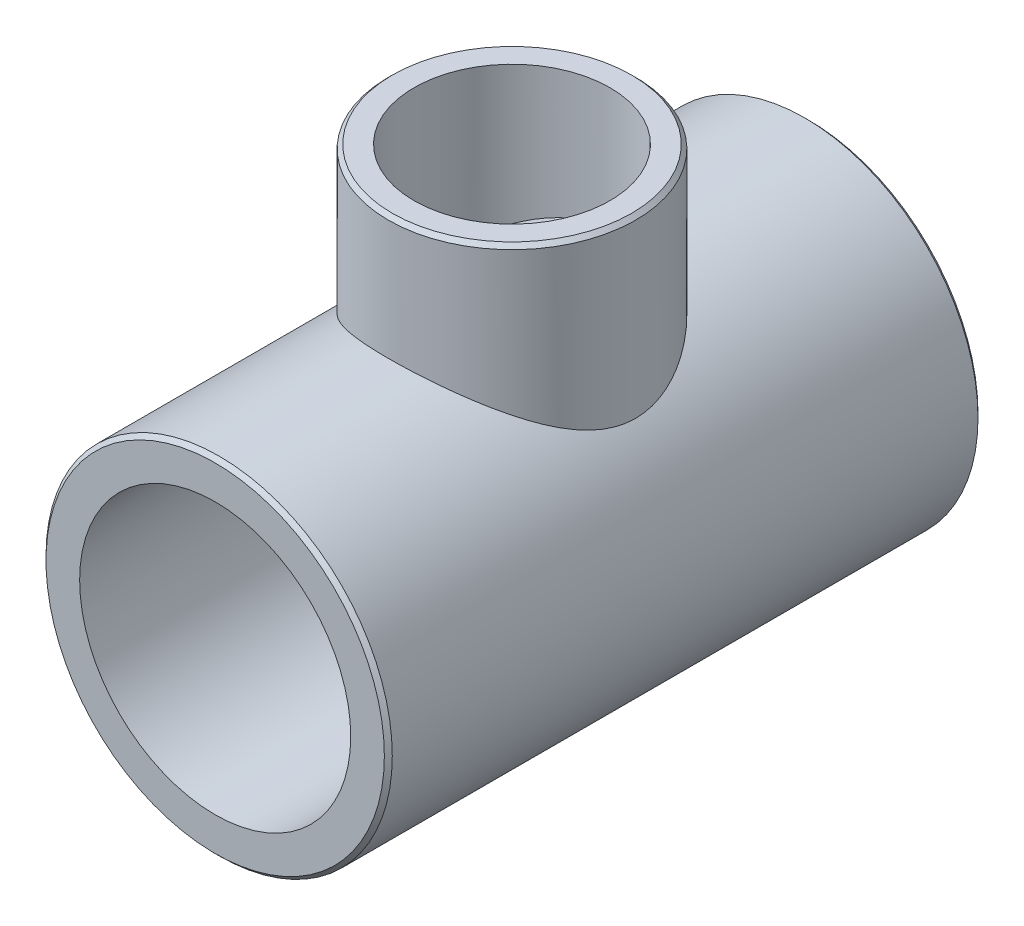
ISO-10303-21;
HEADER;
FILE_DESCRIPTION(('STEP AP214'),'2;1');
FILE_NAME('part.step','',(''),(''),'','','');
FILE_SCHEMA(('AUTOMOTIVE_DESIGN { 1 0 10303 214 1 1 1 1 }'));
ENDSEC;
DATA;
#1=APPLICATION_CONTEXT('core data for automotive mechanical design processes');
#2=APPLICATION_PROTOCOL_DEFINITION('international standard','automotive_design',2000,#1);
#3=PRODUCT_CONTEXT('',#1,'mechanical');
#4=PRODUCT('Part','Part','',(#3));
#5=PRODUCT_RELATED_PRODUCT_CATEGORY('part','',(#4));
#6=PRODUCT_DEFINITION_FORMATION('','',#4);
#7=PRODUCT_DEFINITION_CONTEXT('part definition',#1,'design');
#8=PRODUCT_DEFINITION('design','',#6,#7);
#9=PRODUCT_DEFINITION_SHAPE('','',#8);
#10=(LENGTH_UNIT() NAMED_UNIT(*) SI_UNIT(.MILLI.,.METRE.));
#11=(NAMED_UNIT(*) PLANE_ANGLE_UNIT() SI_UNIT($,.RADIAN.));
#12=(NAMED_UNIT(*) SI_UNIT($,.STERADIAN.) SOLID_ANGLE_UNIT());
#13=UNCERTAINTY_MEASURE_WITH_UNIT(LENGTH_MEASURE(1.E-05),#10,'distance_accuracy_value','');
#14=(GEOMETRIC_REPRESENTATION_CONTEXT(3) GLOBAL_UNCERTAINTY_ASSIGNED_CONTEXT((#13)) GLOBAL_UNIT_ASSIGNED_CONTEXT((#10,
#11,#12)) REPRESENTATION_CONTEXT('',''));
#15=CARTESIAN_POINT('',(0.,0.,0.));
#16=DIRECTION('',(0.,0.,1.));
#17=DIRECTION('',(1.,0.,0.));
#18=AXIS2_PLACEMENT_3D('',#15,#16,#17);
#19=CARTESIAN_POINT('',(0.,0.,19.05));
#20=DIRECTION('',(0.,0.,-1.));
#21=DIRECTION('',(-1.,0.,0.));
#22=AXIS2_PLACEMENT_3D('',#19,#20,#21);
#23=CYLINDRICAL_SURFACE('',#22,8.6995);
#24=CARTESIAN_POINT('',(0.,0.,19.05));
#25=DIRECTION('',(0.,0.,1.));
#26=DIRECTION('',(1.,0.,0.));
#27=AXIS2_PLACEMENT_3D('',#24,#25,#26);
#28=CIRCLE('',#27,8.6995);
#29=CARTESIAN_POINT('',(-8.6995,0.,19.05));
#30=VERTEX_POINT('',#29);
#31=EDGE_CURVE('E79',#30,#30,#28,.T.);
#32=CARTESIAN_POINT('',(0.,0.,-19.05));
#33=DIRECTION('',(0.,0.,1.));
#34=DIRECTION('',(1.,0.,0.));
#35=AXIS2_PLACEMENT_3D('',#32,#33,#34);
#36=CIRCLE('',#35,8.6995);
#37=CARTESIAN_POINT('',(-8.6995,0.,-19.05));
#38=VERTEX_POINT('',#37);
#39=EDGE_CURVE('E108',#38,#38,#36,.T.);
#40=CARTESIAN_POINT('',(-8.6995,0.,19.05));
#41=CARTESIAN_POINT('',(-8.6995,0.,18.653125));
#42=CARTESIAN_POINT('',(-8.6995,0.,18.25625));
#43=CARTESIAN_POINT('',(-8.6995,0.,17.4625));
#44=CARTESIAN_POINT('',(-8.6995,0.,17.065625));
#45=CARTESIAN_POINT('',(-8.6995,0.,16.271875));
#46=CARTESIAN_POINT('',(-8.6995,0.,15.875));
#47=CARTESIAN_POINT('',(-8.6995,0.,15.08125));
#48=CARTESIAN_POINT('',(-8.6995,0.,14.684375));
#49=CARTESIAN_POINT('',(-8.6995,0.,13.890625));
#50=CARTESIAN_POINT('',(-8.6995,0.,13.49375));
#51=CARTESIAN_POINT('',(-8.6995,0.,12.7));
#52=CARTESIAN_POINT('',(-8.6995,0.,12.303125));
#53=CARTESIAN_POINT('',(-8.6995,0.,11.509375));
#54=CARTESIAN_POINT('',(-8.6995,0.,11.1125));
#55=CARTESIAN_POINT('',(-8.6995,0.,10.31875));
#56=CARTESIAN_POINT('',(-8.6995,0.,9.921875));
#57=CARTESIAN_POINT('',(-8.6995,0.,9.128125));
#58=CARTESIAN_POINT('',(-8.6995,0.,8.73125));
#59=CARTESIAN_POINT('',(-8.6995,0.,7.9375));
#60=CARTESIAN_POINT('',(-8.6995,0.,7.540625));
#61=CARTESIAN_POINT('',(-8.6995,0.,6.746875));
#62=CARTESIAN_POINT('',(-8.6995,0.,6.35));
#63=CARTESIAN_POINT('',(-8.6995,0.,5.55625));
#64=CARTESIAN_POINT('',(-8.6995,0.,5.159375));
#65=CARTESIAN_POINT('',(-8.6995,0.,4.365625));
#66=CARTESIAN_POINT('',(-8.6995,0.,3.96875));
#67=CARTESIAN_POINT('',(-8.6995,0.,3.175));
#68=CARTESIAN_POINT('',(-8.6995,0.,2.778125));
#69=CARTESIAN_POINT('',(-8.6995,0.,1.984375));
#70=CARTESIAN_POINT('',(-8.6995,0.,1.5875));
#71=CARTESIAN_POINT('',(-8.6995,0.,0.793749999999997));
#72=CARTESIAN_POINT('',(-8.6995,0.,0.396874999999997));
#73=CARTESIAN_POINT('',(-8.6995,0.,-0.396875000000004));
#74=CARTESIAN_POINT('',(-8.6995,0.,-0.793750000000004));
#75=CARTESIAN_POINT('',(-8.6995,0.,-1.5875));
#76=CARTESIAN_POINT('',(-8.6995,0.,-1.984375));
#77=CARTESIAN_POINT('',(-8.6995,0.,-2.77812500000001));
#78=CARTESIAN_POINT('',(-8.6995,0.,-3.17500000000001));
#79=CARTESIAN_POINT('',(-8.6995,0.,-3.96875000000001));
#80=CARTESIAN_POINT('',(-8.6995,0.,-4.36562500000001));
#81=CARTESIAN_POINT('',(-8.6995,0.,-5.15937500000001));
#82=CARTESIAN_POINT('',(-8.6995,0.,-5.55625));
#83=CARTESIAN_POINT('',(-8.6995,0.,-6.35));
#84=CARTESIAN_POINT('',(-8.6995,0.,-6.746875));
#85=CARTESIAN_POINT('',(-8.6995,0.,-7.540625));
#86=CARTESIAN_POINT('',(-8.6995,0.,-7.93750000000001));
#87=CARTESIAN_POINT('',(-8.6995,0.,-8.73125));
#88=CARTESIAN_POINT('',(-8.6995,0.,-9.12812500000001));
#89=CARTESIAN_POINT('',(-8.6995,0.,-9.92187500000001));
#90=CARTESIAN_POINT('',(-8.6995,0.,-10.31875));
#91=CARTESIAN_POINT('',(-8.6995,0.,-11.1125));
#92=CARTESIAN_POINT('',(-8.6995,0.,-11.509375));
#93=CARTESIAN_POINT('',(-8.6995,0.,-12.303125));
#94=CARTESIAN_POINT('',(-8.6995,0.,-12.7));
#95=CARTESIAN_POINT('',(-8.6995,0.,-13.49375));
#96=CARTESIAN_POINT('',(-8.6995,0.,-13.890625));
#97=CARTESIAN_POINT('',(-8.6995,0.,-14.684375));
#98=CARTESIAN_POINT('',(-8.6995,0.,-15.08125));
#99=CARTESIAN_POINT('',(-8.6995,0.,-15.875));
#100=CARTESIAN_POINT('',(-8.6995,0.,-16.271875));
#101=CARTESIAN_POINT('',(-8.6995,0.,-17.065625));
#102=CARTESIAN_POINT('',(-8.6995,0.,-17.4625));
#103=CARTESIAN_POINT('',(-8.6995,0.,-18.25625));
#104=CARTESIAN_POINT('',(-8.6995,0.,-18.653125));
#105=CARTESIAN_POINT('',(-8.6995,0.,-19.05));
#106=B_SPLINE_CURVE_WITH_KNOTS('',3,(#40,#41,#42,#43,#44,#45,#46,#47,#48,#49,#50,#51,#52,#53,
#54,#55,#56,#57,#58,#59,#60,#61,#62,#63,#64,#65,#66,#67,#68,#69,#70,#71,#72,#73,#74,#75,#76,#77,
#78,#79,#80,#81,#82,#83,#84,#85,#86,#87,#88,#89,#90,#91,#92,#93,#94,#95,#96,#97,#98,#99,#100,
#101,#102,#103,#104,#105),.UNSPECIFIED.,.F.,.F.,(4,2,2,2,2,2,2,2,2,2,2,2,2,2,2,2,2,2,2,2,2,2,2,
2,2,2,2,2,2,2,2,2,4),(0.,1.190625,2.38125,3.571875,4.7625,5.953125,7.14375,8.334375,9.525,
10.715625,11.90625,13.096875,14.2875,15.478125,16.66875,17.859375,19.05,20.240625,21.43125,
22.621875,23.8125,25.003125,26.19375,27.384375,28.575,29.765625,30.95625,32.146875,33.3375,
34.528125,35.71875,36.909375,38.1),.UNSPECIFIED.);
#107=EDGE_CURVE('BSEAM38',#30,#38,#106,.T.);
#108=ORIENTED_EDGE('',*,*,#31,.T.);
#109=ORIENTED_EDGE('',*,*,#39,.F.);
#110=ORIENTED_EDGE('',*,*,#107,.T.);
#111=ORIENTED_EDGE('',*,*,#107,.F.);
#112=EDGE_LOOP('',(#108,#110,#109,#111));
#113=FACE_BOUND('',#112,.T.);
#114=ADVANCED_FACE('F38',(#113),#23,.F.);
#115=CARTESIAN_POINT('',(0.,0.,19.05));
#116=DIRECTION('',(0.,0.,-1.));
#117=DIRECTION('',(-1.,0.,0.));
#118=AXIS2_PLACEMENT_3D('',#115,#116,#117);
#119=CYLINDRICAL_SURFACE('',#118,11.1125);
#120=CARTESIAN_POINT('',(0.,0.,18.796));
#121=DIRECTION('',(0.,0.,1.));
#122=DIRECTION('',(1.,0.,0.));
#123=AXIS2_PLACEMENT_3D('',#120,#121,#122);
#124=CIRCLE('',#123,11.1125);
#125=CARTESIAN_POINT('',(11.1125,0.,18.796));
#126=VERTEX_POINT('',#125);
#127=EDGE_CURVE('E56',#126,#126,#124,.F.);
#128=ORIENTED_EDGE('',*,*,#127,.T.);
#129=EDGE_LOOP('',(#128));
#130=FACE_BOUND('',#129,.T.);
#131=CARTESIAN_POINT('',(0.,0.,-18.796));
#132=DIRECTION('',(0.,0.,1.));
#133=DIRECTION('',(1.,0.,0.));
#134=AXIS2_PLACEMENT_3D('',#131,#132,#133);
#135=CIRCLE('',#134,11.1125);
#136=CARTESIAN_POINT('',(11.1125,0.,-18.796));
#137=VERTEX_POINT('',#136);
#138=EDGE_CURVE('E62',#137,#137,#135,.T.);
#139=ORIENTED_EDGE('',*,*,#138,.T.);
#140=EDGE_LOOP('',(#139));
#141=FACE_BOUND('',#140,.T.);
#142=CARTESIAN_POINT('',(0.,11.1125,7.9375));
#143=CARTESIAN_POINT('',(0.196425340663455,11.1125003330193,7.93750035798998));
#144=CARTESIAN_POINT('',(0.392846435672446,11.1072813165904,7.93019874153173));
#145=CARTESIAN_POINT('',(0.784056037149215,11.0865359659218,7.90111597233613));
#146=CARTESIAN_POINT('',(0.978844591248941,11.0710099334731,7.87933524354933));
#147=CARTESIAN_POINT('',(1.36531639036845,11.0300202310666,7.82163715680664));
#148=CARTESIAN_POINT('',(1.55699850235083,11.0045530165245,7.7857147565194));
#149=CARTESIAN_POINT('',(1.93579912690144,10.9442735972476,7.70027858331352));
#150=CARTESIAN_POINT('',(2.12291754227784,10.90946119368,7.65076452121155));
#151=CARTESIAN_POINT('',(2.49041510089365,10.8314630703653,7.5391264563277));
#152=CARTESIAN_POINT('',(2.6708247327213,10.7883227559874,7.47707075057009));
#153=CARTESIAN_POINT('',(3.02505350621025,10.6944050991264,7.34091143651399));
#154=CARTESIAN_POINT('',(3.19887002464849,10.6436247559729,7.26680309353468));
#155=CARTESIAN_POINT('',(3.53901757595824,10.5354095866145,7.10735760156578));
#156=CARTESIAN_POINT('',(3.70535143210925,10.4779772999904,7.0220247362));
#157=CARTESIAN_POINT('',(4.03009009351049,10.3574149308245,6.84082379548175));
#158=CARTESIAN_POINT('',(4.18849192190175,10.294282733677,6.74495180733402));
#159=CARTESIAN_POINT('',(4.51066870628601,10.1575008816236,6.53437425485555));
#160=CARTESIAN_POINT('',(4.67365873168185,10.0834155172481,6.4187512651582));
#161=CARTESIAN_POINT('',(4.98926799654973,9.93104105909862,6.17662376090673));
#162=CARTESIAN_POINT('',(5.14188598839464,9.85275146162794,6.05011794141536));
#163=CARTESIAN_POINT('',(5.43666589290705,9.69321654246186,5.78668336614895));
#164=CARTESIAN_POINT('',(5.57881151727066,9.61196689838171,5.6497390207667));
#165=CARTESIAN_POINT('',(5.85209234813077,9.44807144945027,5.36616138825542));
#166=CARTESIAN_POINT('',(5.98323078829749,9.3654260632685,5.21953096946416));
#167=CARTESIAN_POINT('',(6.25743585908136,9.18497733294558,4.88903073346635));
#168=CARTESIAN_POINT('',(6.39824919525167,9.0871864359434,4.70327699167241));
#169=CARTESIAN_POINT('',(6.66364866798513,8.89439995750189,4.31905359507126));
#170=CARTESIAN_POINT('',(6.78823038024902,8.79940514363786,4.12058049521427));
#171=CARTESIAN_POINT('',(7.02023303248988,8.61544378532435,3.71153053877185));
#172=CARTESIAN_POINT('',(7.12767473743694,8.52647002287458,3.50096875482254));
#173=CARTESIAN_POINT('',(7.32447752038842,8.35801753584391,3.06796724535161));
#174=CARTESIAN_POINT('',(7.41384841012369,8.27853366828242,2.84553404890951));
#175=CARTESIAN_POINT('',(7.5475448921623,8.15644497583302,2.46279372718139));
#176=CARTESIAN_POINT('',(7.59712037593185,8.11019297402712,2.30546899452192));
#177=CARTESIAN_POINT('',(7.6867790059683,8.02526625982405,1.98615595336382));
#178=CARTESIAN_POINT('',(7.72686505880631,7.98658922787515,1.8241690899497));
#179=CARTESIAN_POINT('',(7.79695599929007,7.91817750216264,1.49646411183777));
#180=CARTESIAN_POINT('',(7.82697855783508,7.88842714342745,1.33075308851488));
#181=CARTESIAN_POINT('',(7.87654259188594,7.8389390857933,0.996272588271304));
#182=CARTESIAN_POINT('',(7.89608407308926,7.81920138145149,0.827503113013234));
#183=CARTESIAN_POINT('',(7.9243991132224,7.79050511315699,0.487007418965531));
#184=CARTESIAN_POINT('',(7.93310072429441,7.78161857968463,0.315269035394072));
#185=CARTESIAN_POINT('',(7.93931107380949,7.77528242096742,-0.0286181824971601));
#186=CARTESIAN_POINT('',(7.93682015850935,7.77783244191642,-0.200767003954779));
#187=CARTESIAN_POINT('',(7.92069464304185,7.79425313819052,-0.544115090337582));
#188=CARTESIAN_POINT('',(7.90705212256054,7.80813185959981,-0.715313593273344));
#189=CARTESIAN_POINT('',(7.86889933643536,7.84657927072498,-1.05527403995681));
#190=CARTESIAN_POINT('',(7.844387838773,7.87114917229983,-1.22403570524464));
#191=CARTESIAN_POINT('',(7.78114289648557,7.93370581933086,-1.57933386344812));
#192=CARTESIAN_POINT('',(7.74099277211905,7.97300545437288,-1.76538735068622));
#193=CARTESIAN_POINT('',(7.64822593599858,8.06203656489136,-2.13173627682233));
#194=CARTESIAN_POINT('',(7.59560731557809,8.11176963737557,-2.31203082934777));
#195=CARTESIAN_POINT('',(7.41998046611311,8.27386389599242,-2.84380366220204));
#196=CARTESIAN_POINT('',(7.27928259992705,8.39903415756283,-3.18572952697295));
#197=CARTESIAN_POINT('',(7.01198209874165,8.62199788782595,-3.72737700338833));
#198=CARTESIAN_POINT('',(6.89722428781368,8.71436559527274,-3.93550523236999));
#199=CARTESIAN_POINT('',(6.65064021322466,8.90397690492428,-4.33921484927877));
#200=CARTESIAN_POINT('',(6.51880911743553,9.001221882715,-4.53479266162751));
#201=CARTESIAN_POINT('',(6.23870487948208,9.19758196997131,-4.91303575012013));
#202=CARTESIAN_POINT('',(6.09041829903794,9.29669855224245,-5.09569027022757));
#203=CARTESIAN_POINT('',(5.777985719515,9.49403349992529,-5.44739329467928));
#204=CARTESIAN_POINT('',(5.61384134177026,9.59225195604162,-5.61644318675621));
#205=CARTESIAN_POINT('',(5.26838661631145,9.78628626502894,-5.94178960050187));
#206=CARTESIAN_POINT('',(5.08692136187195,9.88206837642066,-6.09794207669719));
#207=CARTESIAN_POINT('',(4.70869878229544,10.0677800187826,-6.39451368624109));
#208=CARTESIAN_POINT('',(4.51193993994673,10.1577089674552,-6.53493125521395));
#209=CARTESIAN_POINT('',(4.10423913404165,10.3291669145383,-6.79837604018504));
#210=CARTESIAN_POINT('',(3.89332536153309,10.4107118355254,-6.92143639203282));
#211=CARTESIAN_POINT('',(3.45805121848078,10.5632693654655,-7.14884745082582));
#212=CARTESIAN_POINT('',(3.23369594856036,10.6342859344944,-7.25320519556667));
#213=CARTESIAN_POINT('',(2.83199143485153,10.7470559173452,-7.41741488256231));
#214=CARTESIAN_POINT('',(2.65728751977693,10.7916491105315,-7.48182433032748));
#215=CARTESIAN_POINT('',(2.30213281807742,10.8729481606463,-7.59861912868965));
#216=CARTESIAN_POINT('',(2.12168327585048,10.9096557122975,-7.65100706302512));
#217=CARTESIAN_POINT('',(1.75614731791361,10.974426514561,-7.74308449525955));
#218=CARTESIAN_POINT('',(1.57106338645357,11.0024942935901,-7.78278064580401));
#219=CARTESIAN_POINT('',(1.19737970765415,11.0494069358845,-7.84896103049382));
#220=CARTESIAN_POINT('',(1.00877986190976,11.068251540604,-7.87544489426998));
#221=CARTESIAN_POINT('',(0.628837894150854,11.0963335770959,-7.91486331821942));
#222=CARTESIAN_POINT('',(0.43748891361228,11.1055399809452,-7.9277541196804));
#223=CARTESIAN_POINT('',(0.0541384736333324,11.1140218399395,-7.93963153492938));
#224=CARTESIAN_POINT('',(-0.137862984396865,11.1132973165342,-7.93861817874887));
#225=CARTESIAN_POINT('',(-0.521009231975893,11.1019342241728,-7.92270309045906));
#226=CARTESIAN_POINT('',(-0.712153939935478,11.0912947303456,-7.90780006271743));
#227=CARTESIAN_POINT('',(-1.09208441130564,11.060349654935,-7.86433831392374));
#228=CARTESIAN_POINT('',(-1.28087021810362,11.0400442514066,-7.8357798444175));
#229=CARTESIAN_POINT('',(-1.64574204064057,10.9914252087488,-7.76712527579996));
#230=CARTESIAN_POINT('',(-1.82200292333488,10.9635423082599,-7.72764815020134));
#231=CARTESIAN_POINT('',(-2.17016442362493,10.8999712447244,-7.63718913760762));
#232=CARTESIAN_POINT('',(-2.34206350767074,10.8642803777996,-7.58620326496877));
#233=CARTESIAN_POINT('',(-2.68051045446013,10.7857629432377,-7.4733244767385));
#234=CARTESIAN_POINT('',(-2.84705970414314,10.7429382431429,-7.41143441547437));
#235=CARTESIAN_POINT('',(-3.17415899429693,10.6508821361212,-7.27735554186284));
#236=CARTESIAN_POINT('',(-3.33470681329114,10.601648386477,-7.20516296267455));
#237=CARTESIAN_POINT('',(-3.83484233821447,10.4360828009381,-6.96013785313123));
#238=CARTESIAN_POINT('',(-4.16219474230865,10.3091173863439,-6.76905563085722));
#239=CARTESIAN_POINT('',(-4.78149645599662,10.0369144907758,-6.34681312650125));
#240=CARTESIAN_POINT('',(-5.07341801752143,9.89166286780342,-6.11562177234672));
#241=CARTESIAN_POINT('',(-5.50776260206911,9.65329577860721,-5.71979619650313));
#242=CARTESIAN_POINT('',(-5.66248646945798,9.56316276907223,-5.56662929822277));
#243=CARTESIAN_POINT('',(-5.95855128941679,9.38154906301298,-5.24850391444738));
#244=CARTESIAN_POINT('',(-6.09988998127535,9.29006814183534,-5.08354344528509));
#245=CARTESIAN_POINT('',(-6.36883767291793,9.10779737841371,-4.74226215584166));
#246=CARTESIAN_POINT('',(-6.49643885776663,9.01700795654969,-4.56593495953315));
#247=CARTESIAN_POINT('',(-6.7373452490262,8.83845572332998,-4.20233643333416));
#248=CARTESIAN_POINT('',(-6.8506529741678,8.75069238071813,-4.01506704016351));
#249=CARTESIAN_POINT('',(-7.04590374491736,8.59395451487196,-3.65972937506719));
#250=CARTESIAN_POINT('',(-7.12998561341809,8.52417732033191,-3.49318906409176));
#251=CARTESIAN_POINT('',(-7.28696284672786,8.39037919470693,-3.15265340303857));
#252=CARTESIAN_POINT('',(-7.35985831193099,8.32635821196413,-2.97865811988452));
#253=CARTESIAN_POINT('',(-7.49367816533286,8.2061273580848,-2.62384839313183));
#254=CARTESIAN_POINT('',(-7.55462252730599,8.14990450085676,-2.44304593981543));
#255=CARTESIAN_POINT('',(-7.6638884396202,8.04724182037999,-2.0749789572945));
#256=CARTESIAN_POINT('',(-7.71221452690422,8.00079848203822,-1.88771677819899));
#257=CARTESIAN_POINT('',(-7.78767845857576,7.927291775466,-1.54306275078165));
#258=CARTESIAN_POINT('',(-7.81708534530745,7.89823053992957,-1.3865925335763));
#259=CARTESIAN_POINT('',(-7.86655230347422,7.84896397558195,-1.07087264855775));
#260=CARTESIAN_POINT('',(-7.88661762429562,7.82875367346944,-0.911624594045032));
#261=CARTESIAN_POINT('',(-7.91707100089839,7.79795585964853,-0.591389329725821));
#262=CARTESIAN_POINT('',(-7.92746607581077,7.78736136845687,-0.430403467301386));
#263=CARTESIAN_POINT('',(-7.93841000256024,7.77620510210661,-0.10774267059507));
#264=CARTESIAN_POINT('',(-7.93895870640987,7.77564347773843,0.0539322740069409));
#265=CARTESIAN_POINT('',(-7.93019847806642,7.78457744788831,0.376736107079479));
#266=CARTESIAN_POINT('',(-7.92088929825678,7.79407329503628,0.537864981731486));
#267=CARTESIAN_POINT('',(-7.89258905978297,7.82272942613577,0.858389729939986));
#268=CARTESIAN_POINT('',(-7.87359803467019,7.84188967659634,1.01778560950003));
#269=CARTESIAN_POINT('',(-7.8262341403696,7.8891590699226,1.33399982155627));
#270=CARTESIAN_POINT('',(-7.79785096075642,7.91727804614149,1.49081512168779));
#271=CARTESIAN_POINT('',(-7.73211476270202,7.98148887555289,1.80096094129425));
#272=CARTESIAN_POINT('',(-7.69475656505487,8.01758533133603,1.95428939248578));
#273=CARTESIAN_POINT('',(-7.59743687369072,8.11002517690065,2.30801752073096));
#274=CARTESIAN_POINT('',(-7.53410461836774,8.16908634689135,2.50678488091926));
#275=CARTESIAN_POINT('',(-7.39322174576132,8.29680423374993,2.89604332753672));
#276=CARTESIAN_POINT('',(-7.31566511590818,8.36546500539168,3.08653087185263));
#277=CARTESIAN_POINT('',(-7.14712822252562,8.50990858638449,3.45894343584771));
#278=CARTESIAN_POINT('',(-7.05613150996851,8.58570008101835,3.64085759769202));
#279=CARTESIAN_POINT('',(-6.86148954735965,8.74203632946605,3.99559767323805));
#280=CARTESIAN_POINT('',(-6.75784525204545,8.8225807242574,4.16842427153192));
#281=CARTESIAN_POINT('',(-6.53548817105231,8.98859343319266,4.50930240107358));
#282=CARTESIAN_POINT('',(-6.41644706047939,9.07413578904694,4.6771034032175));
#283=CARTESIAN_POINT('',(-6.16593617955332,9.24618781643941,5.00273425073056));
#284=CARTESIAN_POINT('',(-6.03446192202478,9.33269782720013,5.16056046160769));
#285=CARTESIAN_POINT('',(-5.75940687363863,9.50490509438809,5.46583515639862));
#286=CARTESIAN_POINT('',(-5.61582377548556,9.59060219244123,5.61328165263063));
#287=CARTESIAN_POINT('',(-5.31686381376284,9.75951323553528,5.8972338473946));
#288=CARTESIAN_POINT('',(-5.16148704951374,9.84272720147969,6.03373963804399));
#289=CARTESIAN_POINT('',(-4.81155892806514,10.0190434408705,6.31758598020751));
#290=CARTESIAN_POINT('',(-4.6148609556231,10.1113916107297,6.46276504720213));
#291=CARTESIAN_POINT('',(-4.20632016108839,10.2880541833768,6.73581020559364));
#292=CARTESIAN_POINT('',(-3.99447483039605,10.372367250028,6.86367341906501));
#293=CARTESIAN_POINT('',(-3.55696722643783,10.5304160089502,7.1002568296489));
#294=CARTESIAN_POINT('',(-3.33132359016152,10.6041655376997,7.2090021113492));
#295=CARTESIAN_POINT('',(-2.86752384950872,10.7388641317325,7.40571360487976));
#296=CARTESIAN_POINT('',(-2.62937264264436,10.7998181612365,7.49368787681703));
#297=CARTESIAN_POINT('',(-2.19600584619275,10.8950960089744,7.63028159154988));
#298=CARTESIAN_POINT('',(-2.00280482687568,10.932328431901,7.68330034711007));
#299=CARTESIAN_POINT('',(-1.61137972438335,10.9968369658669,7.77481386647763));
#300=CARTESIAN_POINT('',(-1.41315676737886,11.0241152883471,7.81331185633755));
#301=CARTESIAN_POINT('',(-1.0133474612616,11.0680259000372,7.87514575642913));
#302=CARTESIAN_POINT('',(-0.81176382490769,11.0846663861859,7.89849334094959));
#303=CARTESIAN_POINT('',(-0.406785272879975,11.1069032540257,7.92967026372453));
#304=CARTESIAN_POINT('',(-0.203390360397569,11.1124996551723,7.93749962931611));
#305=CARTESIAN_POINT('',(0.,11.1125,7.9375));
#306=B_SPLINE_CURVE_WITH_KNOTS('',3,(#142,#143,#144,#145,#146,#147,#148,#149,#150,#151,#152,
#153,#154,#155,#156,#157,#158,#159,#160,#161,#162,#163,#164,#165,#166,#167,#168,#169,#170,#171,
#172,#173,#174,#175,#176,#177,#178,#179,#180,#181,#182,#183,#184,#185,#186,#187,#188,#189,#190,
#191,#192,#193,#194,#195,#196,#197,#198,#199,#200,#201,#202,#203,#204,#205,#206,#207,#208,#209,
#210,#211,#212,#213,#214,#215,#216,#217,#218,#219,#220,#221,#222,#223,#224,#225,#226,#227,#228,
#229,#230,#231,#232,#233,#234,#235,#236,#237,#238,#239,#240,#241,#242,#243,#244,#245,#246,#247,
#248,#249,#250,#251,#252,#253,#254,#255,#256,#257,#258,#259,#260,#261,#262,#263,#264,#265,#266,
#267,#268,#269,#270,#271,#272,#273,#274,#275,#276,#277,#278,#279,#280,#281,#282,#283,#284,#285,
#286,#287,#288,#289,#290,#291,#292,#293,#294,#295,#296,#297,#298,#299,#300,#301,#302,#303,#304,
#305),.UNSPECIFIED.,.T.,.F.,(4,2,2,2,2,2,2,2,2,2,2,2,2,2,2,2,2,2,2,2,2,2,2,2,2,2,2,2,2,2,2,2,2,
2,2,2,2,2,2,2,2,2,2,2,2,2,2,2,2,2,2,2,2,2,2,2,2,2,2,2,2,2,2,2,2,2,2,2,2,2,2,2,2,2,2,2,2,2,2,2,2,
4),(0.,0.589065729235821,1.17811421129869,1.7673729140346,2.35664415511938,2.94278896174479,
3.52916458439336,4.11531707377879,4.70168792008125,5.3404620157107,5.97931281244679,
6.61913714598367,7.25877285037872,8.01624680290234,8.77392679219913,9.53068177115609,
10.2870247524728,10.8005336216823,11.3138850012752,11.8263301855448,12.3387750912512,
12.854603450656,13.3704158522837,13.8865949230577,14.4028325186383,14.985010075254,
15.5672768087419,16.7331648071411,17.4973681781487,18.2617883107041,19.0268373616762,
19.7918082750622,20.5644102492779,21.3370889681113,22.1082720366564,22.8791642966953,
23.4529864979778,24.0266852540689,24.6000827999001,25.1734964184105,25.748750383479,
26.324003106061,26.8993094937443,27.4746052841626,28.0223123182293,28.5702093228854,
29.1179631201731,29.6659177045833,30.8603369009955,32.0556855657495,32.7619877307079,
33.46840897578,34.1752299866624,34.8819262701413,35.4789939654903,36.0760563020507,
36.6721121060371,37.2679533001218,37.7529831534715,38.2377401198668,38.7221449510998,
39.2065570627585,39.6909813424751,40.1754039434827,40.6603601031013,41.1455967910261,
41.7950622134146,42.4448027968447,43.095345276212,43.7458386779359,44.4136922841623,
45.0817878482005,45.7500110043003,46.4182285335729,47.2011326637788,47.9841667547635,
48.76616563368,49.5478605604918,50.1584216233202,50.768846958878,51.3788013650785,
51.9887546967742),.UNSPECIFIED.);
#307=CARTESIAN_POINT('',(0.,11.1125,7.9375));
#308=VERTEX_POINT('',#307);
#309=EDGE_CURVE('E101',#308,#308,#306,.T.);
#310=ORIENTED_EDGE('',*,*,#309,.F.);
#311=EDGE_LOOP('',(#310));
#312=FACE_BOUND('',#311,.T.);
#313=ADVANCED_FACE('F81',(#130,#141,#312),#119,.T.);
#314=CARTESIAN_POINT('',(0.,0.,19.05));
#315=DIRECTION('',(0.,0.,1.));
#316=DIRECTION('',(1.,0.,0.));
#317=AXIS2_PLACEMENT_3D('',#314,#315,#316);
#318=PLANE('',#317);
#319=CARTESIAN_POINT('',(0.,0.,19.05));
#320=DIRECTION('',(0.,0.,1.));
#321=DIRECTION('',(1.,0.,0.));
#322=AXIS2_PLACEMENT_3D('',#319,#320,#321);
#323=CIRCLE('',#322,10.8585);
#324=CARTESIAN_POINT('',(10.8585,0.,19.05));
#325=VERTEX_POINT('',#324);
#326=EDGE_CURVE('E66',#325,#325,#323,.T.);
#327=ORIENTED_EDGE('',*,*,#326,.T.);
#328=EDGE_LOOP('',(#327));
#329=FACE_BOUND('',#328,.T.);
#330=ORIENTED_EDGE('',*,*,#31,.F.);
#331=EDGE_LOOP('',(#330));
#332=FACE_BOUND('',#331,.T.);
#333=ADVANCED_FACE('F120',(#329,#332),#318,.T.);
#334=CARTESIAN_POINT('',(0.,0.,-19.05));
#335=DIRECTION('',(0.,0.,1.));
#336=DIRECTION('',(1.,0.,0.));
#337=AXIS2_PLACEMENT_3D('',#334,#335,#336);
#338=PLANE('',#337);
#339=CARTESIAN_POINT('',(0.,0.,-19.05));
#340=DIRECTION('',(0.,0.,1.));
#341=DIRECTION('',(1.,0.,0.));
#342=AXIS2_PLACEMENT_3D('',#339,#340,#341);
#343=CIRCLE('',#342,10.8585);
#344=CARTESIAN_POINT('',(10.8585,0.,-19.05));
#345=VERTEX_POINT('',#344);
#346=EDGE_CURVE('E51',#345,#345,#343,.F.);
#347=ORIENTED_EDGE('',*,*,#346,.T.);
#348=EDGE_LOOP('',(#347));
#349=FACE_BOUND('',#348,.T.);
#350=ORIENTED_EDGE('',*,*,#39,.T.);
#351=EDGE_LOOP('',(#350));
#352=FACE_BOUND('',#351,.T.);
#353=ADVANCED_FACE('F91',(#349,#352),#338,.F.);
#354=CARTESIAN_POINT('',(0.,-11.1135,0.));
#355=DIRECTION('',(0.,1.,0.));
#356=DIRECTION('',(0.,0.,1.));
#357=AXIS2_PLACEMENT_3D('',#354,#355,#356);
#358=CYLINDRICAL_SURFACE('',#357,6.2865);
#359=CARTESIAN_POINT('',(0.,19.05,0.));
#360=DIRECTION('',(0.,1.,0.));
#361=DIRECTION('',(0.,0.,1.));
#362=AXIS2_PLACEMENT_3D('',#359,#360,#361);
#363=CIRCLE('',#362,6.2865);
#364=CARTESIAN_POINT('',(0.,19.05,6.2865));
#365=VERTEX_POINT('',#364);
#366=EDGE_CURVE('E109',#365,#365,#363,.T.);
#367=ORIENTED_EDGE('',*,*,#366,.T.);
#368=EDGE_LOOP('',(#367));
#369=FACE_BOUND('',#368,.T.);
#370=CARTESIAN_POINT('',(0.,11.1125,6.2865));
#371=CARTESIAN_POINT('',(-0.162701820432448,11.1125009805349,6.28650110797988));
#372=CARTESIAN_POINT('',(-0.325390205319943,11.1089195405726,6.28017722138105));
#373=CARTESIAN_POINT('',(-0.64948014788076,11.0946894632531,6.25497163272724));
#374=CARTESIAN_POINT('',(-0.810881730042433,11.0840409607111,6.23609017022779));
#375=CARTESIAN_POINT('',(-1.13115327629289,11.0559483130313,6.18602032022427));
#376=CARTESIAN_POINT('',(-1.29002328544676,11.0385042890028,6.15483215204968));
#377=CARTESIAN_POINT('',(-1.60410445682045,10.9972541416018,6.08054089546272));
#378=CARTESIAN_POINT('',(-1.75931548507478,10.9734477856789,6.03743737152899));
#379=CARTESIAN_POINT('',(-2.06446477150314,10.920143285177,5.94000116883059));
#380=CARTESIAN_POINT('',(-2.21442153830936,10.8906681442377,5.88571381218315));
#381=CARTESIAN_POINT('',(-2.50887901666242,10.8266304192322,5.76635728636972));
#382=CARTESIAN_POINT('',(-2.65337777559243,10.7920660357357,5.70128430264577));
#383=CARTESIAN_POINT('',(-3.07747799153629,10.6818490020388,5.49078418206637));
#384=CARTESIAN_POINT('',(-3.34791268044991,10.5996307085392,5.3300017301941));
#385=CARTESIAN_POINT('',(-3.8777057154709,10.4180153612868,4.95937508044883));
#386=CARTESIAN_POINT('',(-4.13490809818989,10.3178123810185,4.74685467757898));
#387=CARTESIAN_POINT('',(-4.49258070846231,10.1647086169223,4.40050277360696));
#388=CARTESIAN_POINT('',(-4.60720126276198,10.1131627811937,4.28034381147806));
#389=CARTESIAN_POINT('',(-4.82666970245323,10.0102738936137,4.03123892633596));
#390=CARTESIAN_POINT('',(-4.93151587101443,9.95893087889796,3.90229146651911));
#391=CARTESIAN_POINT('',(-5.14151022657111,9.85230110540155,3.62198840588416));
#392=CARTESIAN_POINT('',(-5.24550716225732,9.79717485140715,3.469707573742));
#393=CARTESIAN_POINT('',(-5.44019419491748,9.69042149873287,3.15570679115528));
#394=CARTESIAN_POINT('',(-5.5308854728915,9.63879408971731,2.99398768022834));
#395=CARTESIAN_POINT('',(-5.69808046497105,9.54090739306512,2.66204034405854));
#396=CARTESIAN_POINT('',(-5.77459960819193,9.49464228830875,2.49182163176864));
#397=CARTESIAN_POINT('',(-5.91266901818002,9.40928262298036,2.14370218667176));
#398=CARTESIAN_POINT('',(-5.97422406496613,9.37018577361802,1.96580392840023));
#399=CARTESIAN_POINT('',(-6.06980913018046,9.30846738590473,1.64297316145443));
#400=CARTESIAN_POINT('',(-6.10691372659302,9.2841118712849,1.49927599062292));
#401=CARTESIAN_POINT('',(-6.17099127413141,9.24164516591683,1.20874502070315));
#402=CARTESIAN_POINT('',(-6.19796633730764,9.22353267353687,1.06191188223276));
#403=CARTESIAN_POINT('',(-6.24142817615158,9.19417861571554,0.766145325768874));
#404=CARTESIAN_POINT('',(-6.25792389966253,9.18293118882198,0.617213810870375));
#405=CARTESIAN_POINT('',(-6.28023293717786,9.16768864109327,0.318174950410368));
#406=CARTESIAN_POINT('',(-6.28604603382779,9.16369366782044,0.168067580986699));
#407=CARTESIAN_POINT('',(-6.28690332219901,9.16310554784032,-0.132381079668432));
#408=CARTESIAN_POINT('',(-6.28193398971326,9.16652169676951,-0.282722428047901));
#409=CARTESIAN_POINT('',(-6.26127276552896,9.18064673057006,-0.582317048085723));
#410=CARTESIAN_POINT('',(-6.2455808337674,9.19135564268949,-0.731570315676559));
#411=CARTESIAN_POINT('',(-6.2036886856122,9.21968217247828,-1.0279800355953));
#412=CARTESIAN_POINT('',(-6.17748447747681,9.23730241447444,-1.17513566940025));
#413=CARTESIAN_POINT('',(-6.11489441701212,9.27885393937804,-1.46640746320997));
#414=CARTESIAN_POINT('',(-6.07850445774703,9.30278776772433,-1.61052237192418));
#415=CARTESIAN_POINT('',(-5.99607202069412,9.35613041916912,-1.89446436723761));
#416=CARTESIAN_POINT('',(-5.9500570020064,9.38552364112735,-2.03430238166855));
#417=CARTESIAN_POINT('',(-5.84874381693699,9.44899053458237,-2.30950104897862));
#418=CARTESIAN_POINT('',(-5.7934425976431,9.48306574464818,-2.44486021182395));
#419=CARTESIAN_POINT('',(-5.61427819453184,9.59098468917775,-2.84337199432426));
#420=CARTESIAN_POINT('',(-5.47711311452479,9.67054952248142,-3.09909885930885));
#421=CARTESIAN_POINT('',(-5.1463254074617,9.85107680325633,-3.62585094639234));
#422=CARTESIAN_POINT('',(-4.94721624136086,9.95343648639828,-3.89295663151594));
#423=CARTESIAN_POINT('',(-4.61923404954683,10.1076715917145,-4.26735907335004));
#424=CARTESIAN_POINT('',(-4.50492543408358,10.1592373759622,-4.38786275557062));
#425=CARTESIAN_POINT('',(-4.26687828310076,10.2614894607751,-4.61967789342522));
#426=CARTESIAN_POINT('',(-4.14313817495337,10.3121756129311,-4.73098780959483));
#427=CARTESIAN_POINT('',(-3.87266302709033,10.4169773790316,-4.95547669393542));
#428=CARTESIAN_POINT('',(-3.72489439536826,10.4708595167671,-5.06752198573147));
#429=CARTESIAN_POINT('',(-3.41913542328424,10.5746498132386,-5.27864479046106));
#430=CARTESIAN_POINT('',(-3.26114929495561,10.62455959084,-5.37772759673407));
#431=CARTESIAN_POINT('',(-2.93579567034435,10.7190225382362,-5.56202569611648));
#432=CARTESIAN_POINT('',(-2.76843031004326,10.7635769204331,-5.6472441295163));
#433=CARTESIAN_POINT('',(-2.42537034504908,10.8460288084759,-5.80285472412864));
#434=CARTESIAN_POINT('',(-2.24967677091249,10.8839271352441,-5.87324871392237));
#435=CARTESIAN_POINT('',(-1.90380818824345,10.9495185207521,-5.99389361198163));
#436=CARTESIAN_POINT('',(-1.73410426243757,10.9777393406398,-6.04520770370067));
#437=CARTESIAN_POINT('',(-1.38992830431218,11.0266021746783,-6.13349294630819));
#438=CARTESIAN_POINT('',(-1.21545645110061,11.0472444730982,-6.17046463518064));
#439=CARTESIAN_POINT('',(-0.863376621514597,11.08031929124,-6.22948625560444));
#440=CARTESIAN_POINT('',(-0.685771235560419,11.0927582933787,-6.25154796967334));
#441=CARTESIAN_POINT('',(-0.32894086978303,11.1090656034538,-6.28043863841631));
#442=CARTESIAN_POINT('',(-0.149716065100254,11.1129348273324,-6.28726922100201));
#443=CARTESIAN_POINT('',(0.187336159651287,11.1120434053264,-6.28569237056785));
#444=CARTESIAN_POINT('',(0.345177487840117,11.1082528783465,-6.27899792513614));
#445=CARTESIAN_POINT('',(0.659665947860459,11.0940198582256,-6.25378383590938));
#446=CARTESIAN_POINT('',(0.816312668386236,11.0835751701846,-6.23526029023643));
#447=CARTESIAN_POINT('',(1.12716080243328,11.0562878798776,-6.1866252297807));
#448=CARTESIAN_POINT('',(1.28136315121003,11.0394477893121,-6.15651826415552));
#449=CARTESIAN_POINT('',(1.58640513125758,10.9997565993534,-6.08505982383509));
#450=CARTESIAN_POINT('',(1.73724344030478,10.9769031800852,-6.04370400925172));
#451=CARTESIAN_POINT('',(2.03334816028533,10.9259109225255,-5.95058503558884));
#452=CARTESIAN_POINT('',(2.17865027225991,10.8978172431423,-5.89891054941475));
#453=CARTESIAN_POINT('',(2.46422661126357,10.8368168524234,-5.78543895153924));
#454=CARTESIAN_POINT('',(2.60449906990389,10.8039084685379,-5.72363832128221));
#455=CARTESIAN_POINT('',(3.01665657431143,10.6989549717049,-5.52385605327465));
#456=CARTESIAN_POINT('',(3.280087678118,10.6206446378569,-5.37142850289346));
#457=CARTESIAN_POINT('',(3.80590316889728,10.4444953154606,-5.01462298346657));
#458=CARTESIAN_POINT('',(4.06533926894953,10.3454729254092,-4.80649440345826));
#459=CARTESIAN_POINT('',(4.42683856560394,10.1935246503225,-4.46661007246948));
#460=CARTESIAN_POINT('',(4.54281898151944,10.1422595198369,-4.34858403805036));
#461=CARTESIAN_POINT('',(4.76513304737203,10.039728836891,-4.10377409673654));
#462=CARTESIAN_POINT('',(4.8714650268895,9.98846328588841,-3.97698868000995));
#463=CARTESIAN_POINT('',(5.19711893523343,9.82549583503387,-3.55588241399428));
#464=CARTESIAN_POINT('',(5.39696648957778,9.71594941222153,-3.24496419170605));
#465=CARTESIAN_POINT('',(5.65473349959242,9.56669154946045,-2.7528984671173));
#466=CARTESIAN_POINT('',(5.73365179774535,9.51945149880423,-2.58460553750083));
#467=CARTESIAN_POINT('',(5.87679006216137,9.43175597806651,-2.24011920712912));
#468=CARTESIAN_POINT('',(5.9410145156508,9.39129843774408,-2.0639282379972));
#469=CARTESIAN_POINT('',(6.04186828352359,9.3266433346429,-1.74296359441521));
#470=CARTESIAN_POINT('',(6.08146118604565,9.30081679829131,-1.59943929157517));
#471=CARTESIAN_POINT('',(6.15051153329057,9.25529993990514,-1.30902635197826));
#472=CARTESIAN_POINT('',(6.17997109844844,9.23560833419704,-1.16213842594063));
#473=CARTESIAN_POINT('',(6.22836842534467,9.20303953532859,-0.866023125645623));
#474=CARTESIAN_POINT('',(6.24731556868313,9.19015626669391,-0.716797959918273));
#475=CARTESIAN_POINT('',(6.27446622535779,9.17164118642524,-0.416917040580855));
#476=CARTESIAN_POINT('',(6.28266955462817,9.16600949902726,-0.266261262505702));
#477=CARTESIAN_POINT('',(6.28821454663714,9.16220639654973,0.0356057193901845));
#478=CARTESIAN_POINT('',(6.28553744071979,9.16404787260396,0.186817433050928));
#479=CARTESIAN_POINT('',(6.26931969911513,9.17515023431672,0.488379722121738));
#480=CARTESIAN_POINT('',(6.2557790236751,9.18441114712497,0.638730294378628));
#481=CARTESIAN_POINT('',(6.21802399196061,9.21001364206236,0.937520742517336));
#482=CARTESIAN_POINT('',(6.19380589540741,9.22635770537042,1.08595993007499));
#483=CARTESIAN_POINT('',(6.13500727761085,9.26555919775847,1.37994654664117));
#484=CARTESIAN_POINT('',(6.10042257624475,9.28841925409746,1.52549278383413));
#485=CARTESIAN_POINT('',(6.02179045855737,9.33958591489132,1.81101490676109));
#486=CARTESIAN_POINT('',(5.97786597895821,9.36782130327043,1.9510375389982));
#487=CARTESIAN_POINT('',(5.88073093258138,9.42910143130465,2.22676191755175));
#488=CARTESIAN_POINT('',(5.82751731952987,9.46214774806118,2.36246222909236));
#489=CARTESIAN_POINT('',(5.65460585673514,9.56719888896062,2.76220357751929));
#490=CARTESIAN_POINT('',(5.52159711290039,9.6451432634738,3.01902931689047));
#491=CARTESIAN_POINT('',(5.20039774288733,9.82252464297712,3.54763664195268));
#492=CARTESIAN_POINT('',(5.00687683624913,9.92342524836502,3.81568980184202));
#493=CARTESIAN_POINT('',(4.68748281996047,10.0761688248873,4.19222369653331));
#494=CARTESIAN_POINT('',(4.576075121668,10.1273528963453,4.31355565543568));
#495=CARTESIAN_POINT('',(4.34389145625836,10.2290913226874,4.54728658697773));
#496=CARTESIAN_POINT('',(4.22311391353765,10.2796455699961,4.65968405075915));
#497=CARTESIAN_POINT('',(3.95797788510223,10.384831484856,4.88759000312818));
#498=CARTESIAN_POINT('',(3.8125151672002,10.4392458445782,5.00191690958882));
#499=CARTESIAN_POINT('',(3.51124395754422,10.544394861709,5.21781309135617));
#500=CARTESIAN_POINT('',(3.35543958171406,10.5951309664209,5.31938739613874));
#501=CARTESIAN_POINT('',(3.03425745721489,10.6915408441192,5.50891352108339));
#502=CARTESIAN_POINT('',(2.8688800303719,10.7372147871346,5.59686579882469));
#503=CARTESIAN_POINT('',(2.52957762270748,10.8221748139118,5.75817642784401));
#504=CARTESIAN_POINT('',(2.35565332978731,10.8614614106713,5.83153595124013));
#505=CARTESIAN_POINT('',(2.00607131415703,10.9313359137703,5.9606530821419));
#506=CARTESIAN_POINT('',(1.83063721348043,10.9621570922882,6.01688870054987));
#507=CARTESIAN_POINT('',(1.47434082293824,11.0157350991639,6.11395830940717));
#508=CARTESIAN_POINT('',(1.29347858423327,11.0384920035024,6.15479244496754));
#509=CARTESIAN_POINT('',(0.928136875012846,11.0751926686537,6.22037437324817));
#510=CARTESIAN_POINT('',(0.743660703133342,11.0891441125826,6.24513619024573));
#511=CARTESIAN_POINT('',(0.372783637391189,11.1077966009192,6.27819727324304));
#512=CARTESIAN_POINT('',(0.186383003071235,11.1124988767487,6.28649873075411));
#513=CARTESIAN_POINT('',(0.,11.1125,6.2865));
#514=B_SPLINE_CURVE_WITH_KNOTS('',3,(#370,#371,#372,#373,#374,#375,#376,#377,#378,#379,#380,
#381,#382,#383,#384,#385,#386,#387,#388,#389,#390,#391,#392,#393,#394,#395,#396,#397,#398,#399,
#400,#401,#402,#403,#404,#405,#406,#407,#408,#409,#410,#411,#412,#413,#414,#415,#416,#417,#418,
#419,#420,#421,#422,#423,#424,#425,#426,#427,#428,#429,#430,#431,#432,#433,#434,#435,#436,#437,
#438,#439,#440,#441,#442,#443,#444,#445,#446,#447,#448,#449,#450,#451,#452,#453,#454,#455,#456,
#457,#458,#459,#460,#461,#462,#463,#464,#465,#466,#467,#468,#469,#470,#471,#472,#473,#474,#475,
#476,#477,#478,#479,#480,#481,#482,#483,#484,#485,#486,#487,#488,#489,#490,#491,#492,#493,#494,
#495,#496,#497,#498,#499,#500,#501,#502,#503,#504,#505,#506,#507,#508,#509,#510,#511,#512,#513),
.UNSPECIFIED.,.T.,.F.,(4,2,2,2,2,2,2,2,2,2,2,2,2,2,2,2,2,2,2,2,2,2,2,2,2,2,2,2,2,2,2,2,2,2,2,2,
2,2,2,2,2,2,2,2,2,2,2,2,2,2,2,2,2,2,2,2,2,2,2,2,2,2,2,2,2,2,2,2,2,2,2,4),(0.,0.487921238668295,
0.975833169737623,1.46373640565747,1.951657477418,2.43763884517421,2.92379245839034,
3.89537433305646,4.93606178829599,5.45728626119509,5.97860211320136,6.55530127047033,
7.13194920935278,7.70796561675846,8.28379778330941,8.73452024458975,9.1851486760865,
9.63539181695702,10.0856441186139,10.5364614900654,10.9872805459217,11.4382709499341,
11.8894434576824,12.3393459652488,12.7893966724602,13.6890569898919,14.7302123952843,
15.2515569421458,15.7729886101191,16.3516027818869,16.9299799292337,17.5082258908073,
18.086400484452,18.6242095962084,19.1619985327778,19.6993619863951,20.2366680035604,
20.710177016031,21.183842298151,21.6573217472326,22.1309841278843,22.6007388992577,
23.070657244951,24.009843329258,25.0465390871344,25.5658010734237,26.0851527879323,
27.2347560371106,27.8094918126998,28.3840518397227,28.83692322184,29.2896997813628,
29.7420716168982,30.1944512024842,30.6476114698295,31.1007733954176,31.5540941889821,
32.0075980214094,32.4554660458752,32.9034812208313,33.7990592743109,34.8317260063784,
35.3488060867296,35.8659733068975,36.4438041538741,37.0214063904831,37.5989892205729,
38.176525639349,38.7360321799151,39.2955334487415,39.8545458529975,40.4134838260547),.UNSPECIFIED.);
#515=CARTESIAN_POINT('',(0.,11.1125,6.2865));
#516=VERTEX_POINT('',#515);
#517=EDGE_CURVE('E70',#516,#516,#514,.T.);
#518=ORIENTED_EDGE('',*,*,#517,.T.);
#519=EDGE_LOOP('',(#518));
#520=FACE_BOUND('',#519,.T.);
#521=ADVANCED_FACE('F85',(#369,#520),#358,.F.);
#522=CARTESIAN_POINT('',(0.,19.05,0.));
#523=DIRECTION('',(0.,1.,0.));
#524=DIRECTION('',(0.,0.,1.));
#525=AXIS2_PLACEMENT_3D('',#522,#523,#524);
#526=PLANE('',#525);
#527=CARTESIAN_POINT('',(0.,19.05,0.));
#528=DIRECTION('',(0.,1.,0.));
#529=DIRECTION('',(0.,0.,1.));
#530=AXIS2_PLACEMENT_3D('',#527,#528,#529);
#531=CIRCLE('',#530,7.6835);
#532=CARTESIAN_POINT('',(0.,19.05,7.6835));
#533=VERTEX_POINT('',#532);
#534=EDGE_CURVE('E46',#533,#533,#531,.T.);
#535=ORIENTED_EDGE('',*,*,#534,.T.);
#536=EDGE_LOOP('',(#535));
#537=FACE_BOUND('',#536,.T.);
#538=ORIENTED_EDGE('',*,*,#366,.F.);
#539=EDGE_LOOP('',(#538));
#540=FACE_BOUND('',#539,.T.);
#541=ADVANCED_FACE('F90',(#537,#540),#526,.T.);
#542=CARTESIAN_POINT('',(0.,-11.1135,0.));
#543=DIRECTION('',(0.,1.,0.));
#544=DIRECTION('',(0.,0.,1.));
#545=AXIS2_PLACEMENT_3D('',#542,#543,#544);
#546=CYLINDRICAL_SURFACE('',#545,7.9375);
#547=CARTESIAN_POINT('',(0.,18.796,0.));
#548=DIRECTION('',(0.,1.,0.));
#549=DIRECTION('',(0.,0.,1.));
#550=AXIS2_PLACEMENT_3D('',#547,#548,#549);
#551=CIRCLE('',#550,7.9375);
#552=CARTESIAN_POINT('',(0.,18.796,7.9375));
#553=VERTEX_POINT('',#552);
#554=EDGE_CURVE('E10',#553,#553,#551,.F.);
#555=ORIENTED_EDGE('',*,*,#554,.T.);
#556=EDGE_LOOP('',(#555));
#557=FACE_BOUND('',#556,.T.);
#558=ORIENTED_EDGE('',*,*,#309,.T.);
#559=EDGE_LOOP('',(#558));
#560=FACE_BOUND('',#559,.T.);
#561=ADVANCED_FACE('F93',(#557,#560),#546,.T.);
#562=ORIENTED_EDGE('',*,*,#517,.F.);
#563=EDGE_LOOP('',(#562));
#564=FACE_BOUND('',#563,.T.);
#565=ADVANCED_FACE('F97',(#564),#119,.T.);
#566=CARTESIAN_POINT('',(0.,0.,19.05));
#567=DIRECTION('',(0.,0.,-1.));
#568=DIRECTION('',(-1.,0.,0.));
#569=AXIS2_PLACEMENT_3D('',#566,#567,#568);
#570=CONICAL_SURFACE('',#569,10.8585,0.785398163397448);
#571=ORIENTED_EDGE('',*,*,#127,.F.);
#572=EDGE_LOOP('',(#571));
#573=FACE_BOUND('',#572,.T.);
#574=ORIENTED_EDGE('',*,*,#326,.F.);
#575=EDGE_LOOP('',(#574));
#576=FACE_BOUND('',#575,.T.);
#577=ADVANCED_FACE('F133',(#573,#576),#570,.T.);
#578=CARTESIAN_POINT('',(0.,0.,-18.796));
#579=DIRECTION('',(0.,0.,1.));
#580=DIRECTION('',(1.,0.,0.));
#581=AXIS2_PLACEMENT_3D('',#578,#579,#580);
#582=CONICAL_SURFACE('',#581,11.1125,0.785398163397448);
#583=ORIENTED_EDGE('',*,*,#346,.F.);
#584=EDGE_LOOP('',(#583));
#585=FACE_BOUND('',#584,.T.);
#586=ORIENTED_EDGE('',*,*,#138,.F.);
#587=EDGE_LOOP('',(#586));
#588=FACE_BOUND('',#587,.T.);
#589=ADVANCED_FACE('F135',(#585,#588),#582,.T.);
#590=CARTESIAN_POINT('',(0.,19.05,0.));
#591=DIRECTION('',(0.,-1.,0.));
#592=DIRECTION('',(0.,0.,-1.));
#593=AXIS2_PLACEMENT_3D('',#590,#591,#592);
#594=CONICAL_SURFACE('',#593,7.6835,0.785398163397442);
#595=ORIENTED_EDGE('',*,*,#554,.F.);
#596=EDGE_LOOP('',(#595));
#597=FACE_BOUND('',#596,.T.);
#598=ORIENTED_EDGE('',*,*,#534,.F.);
#599=EDGE_LOOP('',(#598));
#600=FACE_BOUND('',#599,.T.);
#601=ADVANCED_FACE('F40',(#597,#600),#594,.T.);
#602=CLOSED_SHELL('',(#114,#313,#333,#353,#521,#541,#561,#565,#577,#589,#601));
#603=MANIFOLD_SOLID_BREP('B2',#602);
#604=ADVANCED_BREP_SHAPE_REPRESENTATION('',(#18,#603),#14);
#605=SHAPE_DEFINITION_REPRESENTATION(#9,#604);
ENDSEC;
END-ISO-10303-21;
